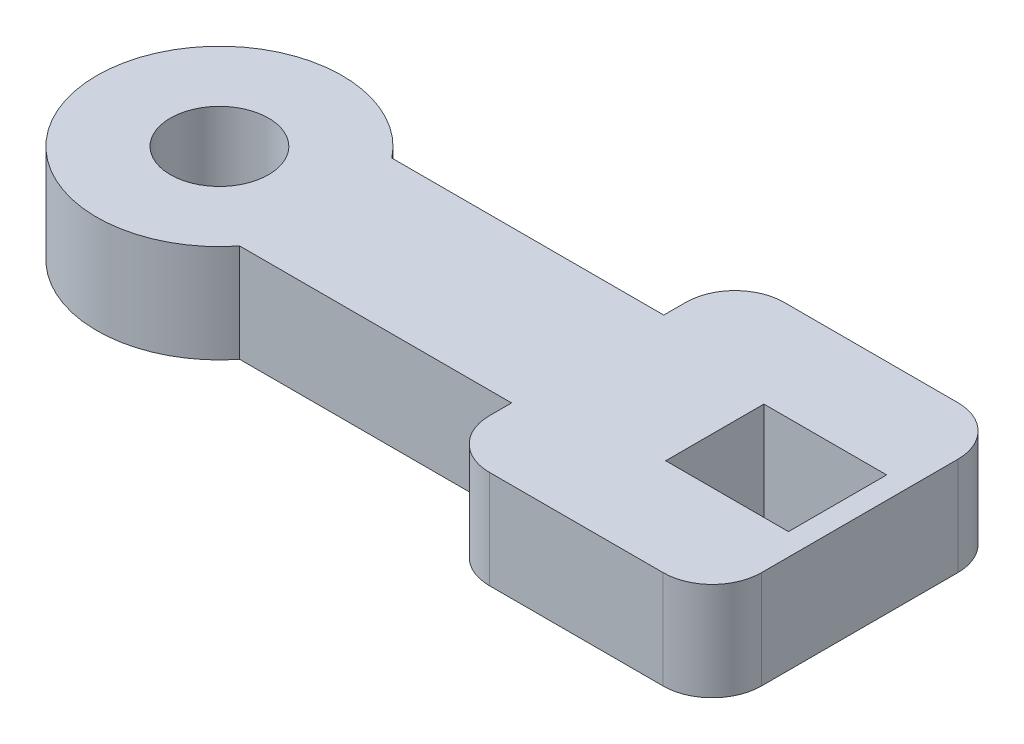
ISO-10303-21;
HEADER;
FILE_DESCRIPTION(('STEP AP214'),'2;1');
FILE_NAME('part.step','',(''),(''),'','','');
FILE_SCHEMA(('AUTOMOTIVE_DESIGN { 1 0 10303 214 1 1 1 1 }'));
ENDSEC;
DATA;
#1=APPLICATION_CONTEXT('core data for automotive mechanical design processes');
#2=APPLICATION_PROTOCOL_DEFINITION('international standard','automotive_design',2000,#1);
#3=PRODUCT_CONTEXT('',#1,'mechanical');
#4=PRODUCT('Part','Part','',(#3));
#5=PRODUCT_RELATED_PRODUCT_CATEGORY('part','',(#4));
#6=PRODUCT_DEFINITION_FORMATION('','',#4);
#7=PRODUCT_DEFINITION_CONTEXT('part definition',#1,'design');
#8=PRODUCT_DEFINITION('design','',#6,#7);
#9=PRODUCT_DEFINITION_SHAPE('','',#8);
#10=(LENGTH_UNIT() NAMED_UNIT(*) SI_UNIT(.MILLI.,.METRE.));
#11=(NAMED_UNIT(*) PLANE_ANGLE_UNIT() SI_UNIT($,.RADIAN.));
#12=(NAMED_UNIT(*) SI_UNIT($,.STERADIAN.) SOLID_ANGLE_UNIT());
#13=UNCERTAINTY_MEASURE_WITH_UNIT(LENGTH_MEASURE(1.E-05),#10,'distance_accuracy_value','');
#14=(GEOMETRIC_REPRESENTATION_CONTEXT(3) GLOBAL_UNCERTAINTY_ASSIGNED_CONTEXT((#13)) GLOBAL_UNIT_ASSIGNED_CONTEXT((#10,
#11,#12)) REPRESENTATION_CONTEXT('',''));
#15=CARTESIAN_POINT('',(0.,0.,0.));
#16=DIRECTION('',(0.,0.,1.));
#17=DIRECTION('',(1.,0.,0.));
#18=AXIS2_PLACEMENT_3D('',#15,#16,#17);
#19=CARTESIAN_POINT('',(15.0896575459696,2.,0.));
#20=DIRECTION('',(-1.,0.,0.));
#21=DIRECTION('',(0.,0.,1.));
#22=AXIS2_PLACEMENT_3D('',#19,#20,#21);
#23=PLANE('',#22);
#24=DIRECTION('',(0.,0.,-1.));
#25=VECTOR('',#24,1.);
#26=CARTESIAN_POINT('',(15.0896575459696,0.,0.));
#27=LINE('',#26,#25);
#28=CARTESIAN_POINT('',(15.0896575459696,0.,1.));
#29=VERTEX_POINT('',#28);
#30=CARTESIAN_POINT('',(15.0896575459696,0.,-1.));
#31=VERTEX_POINT('',#30);
#32=EDGE_CURVE('E241',#29,#31,#27,.T.);
#33=ORIENTED_EDGE('',*,*,#32,.F.);
#34=DIRECTION('',(0.,-1.,0.));
#35=VECTOR('',#34,1.);
#36=CARTESIAN_POINT('',(15.0896575459696,2.,1.));
#37=LINE('',#36,#35);
#38=CARTESIAN_POINT('',(15.0896575459696,2.,1.));
#39=VERTEX_POINT('',#38);
#40=EDGE_CURVE('E11',#39,#29,#37,.T.);
#41=ORIENTED_EDGE('',*,*,#40,.F.);
#42=DIRECTION('',(0.,0.,-1.));
#43=VECTOR('',#42,1.);
#44=CARTESIAN_POINT('',(15.0896575459696,2.,0.));
#45=LINE('',#44,#43);
#46=CARTESIAN_POINT('',(15.0896575459696,2.,-1.));
#47=VERTEX_POINT('',#46);
#48=EDGE_CURVE('E183',#39,#47,#45,.T.);
#49=ORIENTED_EDGE('',*,*,#48,.T.);
#50=DIRECTION('',(0.,-1.,0.));
#51=VECTOR('',#50,1.);
#52=CARTESIAN_POINT('',(15.0896575459696,2.,-1.));
#53=LINE('',#52,#51);
#54=EDGE_CURVE('E118',#47,#31,#53,.T.);
#55=ORIENTED_EDGE('',*,*,#54,.T.);
#56=EDGE_LOOP('',(#33,#41,#49,#55));
#57=FACE_BOUND('',#56,.T.);
#58=ADVANCED_FACE('F39',(#57),#23,.T.);
#59=CARTESIAN_POINT('',(0.,2.,1.));
#60=DIRECTION('',(0.,0.,-1.));
#61=DIRECTION('',(-1.,0.,0.));
#62=AXIS2_PLACEMENT_3D('',#59,#60,#61);
#63=PLANE('',#62);
#64=DIRECTION('',(1.,0.,0.));
#65=VECTOR('',#64,1.);
#66=CARTESIAN_POINT('',(0.,0.,1.));
#67=LINE('',#66,#65);
#68=CARTESIAN_POINT('',(12.5896575459696,0.,1.));
#69=VERTEX_POINT('',#68);
#70=EDGE_CURVE('E171',#69,#29,#67,.T.);
#71=ORIENTED_EDGE('',*,*,#70,.F.);
#72=DIRECTION('',(0.,-1.,0.));
#73=VECTOR('',#72,1.);
#74=CARTESIAN_POINT('',(12.5896575459696,2.,1.));
#75=LINE('',#74,#73);
#76=CARTESIAN_POINT('',(12.5896575459696,2.,1.));
#77=VERTEX_POINT('',#76);
#78=EDGE_CURVE('E50',#77,#69,#75,.T.);
#79=ORIENTED_EDGE('',*,*,#78,.F.);
#80=DIRECTION('',(1.,0.,0.));
#81=VECTOR('',#80,1.);
#82=CARTESIAN_POINT('',(0.,2.,1.));
#83=LINE('',#82,#81);
#84=EDGE_CURVE('E169',#77,#39,#83,.T.);
#85=ORIENTED_EDGE('',*,*,#84,.T.);
#86=ORIENTED_EDGE('',*,*,#40,.T.);
#87=EDGE_LOOP('',(#71,#79,#85,#86));
#88=FACE_BOUND('',#87,.T.);
#89=ADVANCED_FACE('F167',(#88),#63,.T.);
#90=CARTESIAN_POINT('',(12.5896575459696,2.,0.));
#91=DIRECTION('',(-1.,0.,0.));
#92=DIRECTION('',(0.,0.,1.));
#93=AXIS2_PLACEMENT_3D('',#90,#91,#92);
#94=PLANE('',#93);
#95=DIRECTION('',(0.,0.,-1.));
#96=VECTOR('',#95,1.);
#97=CARTESIAN_POINT('',(12.5896575459696,0.,0.));
#98=LINE('',#97,#96);
#99=CARTESIAN_POINT('',(12.5896575459696,0.,-1.));
#100=VERTEX_POINT('',#99);
#101=EDGE_CURVE('E246',#69,#100,#98,.T.);
#102=ORIENTED_EDGE('',*,*,#101,.T.);
#103=DIRECTION('',(0.,-1.,0.));
#104=VECTOR('',#103,1.);
#105=CARTESIAN_POINT('',(12.5896575459696,2.,-1.));
#106=LINE('',#105,#104);
#107=CARTESIAN_POINT('',(12.5896575459696,2.,-1.));
#108=VERTEX_POINT('',#107);
#109=EDGE_CURVE('E175',#108,#100,#106,.T.);
#110=ORIENTED_EDGE('',*,*,#109,.F.);
#111=DIRECTION('',(0.,0.,-1.));
#112=VECTOR('',#111,1.);
#113=CARTESIAN_POINT('',(12.5896575459696,2.,0.));
#114=LINE('',#113,#112);
#115=EDGE_CURVE('E178',#77,#108,#114,.T.);
#116=ORIENTED_EDGE('',*,*,#115,.F.);
#117=ORIENTED_EDGE('',*,*,#78,.T.);
#118=EDGE_LOOP('',(#102,#110,#116,#117));
#119=FACE_BOUND('',#118,.T.);
#120=ADVANCED_FACE('F179',(#119),#94,.F.);
#121=CARTESIAN_POINT('',(0.,2.,-1.55));
#122=DIRECTION('',(0.,0.,1.));
#123=DIRECTION('',(1.,0.,0.));
#124=AXIS2_PLACEMENT_3D('',#121,#122,#123);
#125=PLANE('',#124);
#126=DIRECTION('',(-1.,0.,0.));
#127=VECTOR('',#126,1.);
#128=CARTESIAN_POINT('',(0.,0.,-1.55));
#129=LINE('',#128,#127);
#130=CARTESIAN_POINT('',(10.,0.,-1.55));
#131=VERTEX_POINT('',#130);
#132=CARTESIAN_POINT('',(4.4615045245933,0.,-1.55));
#133=VERTEX_POINT('',#132);
#134=EDGE_CURVE('E198',#131,#133,#129,.T.);
#135=ORIENTED_EDGE('',*,*,#134,.T.);
#136=DIRECTION('',(0.,-1.,0.));
#137=VECTOR('',#136,1.);
#138=CARTESIAN_POINT('',(4.4615045245933,2.,-1.55));
#139=LINE('',#138,#137);
#140=CARTESIAN_POINT('',(4.4615045245933,2.,-1.55));
#141=VERTEX_POINT('',#140);
#142=EDGE_CURVE('E43',#141,#133,#139,.T.);
#143=ORIENTED_EDGE('',*,*,#142,.F.);
#144=DIRECTION('',(-1.,0.,0.));
#145=VECTOR('',#144,1.);
#146=CARTESIAN_POINT('',(0.,2.,-1.55));
#147=LINE('',#146,#145);
#148=CARTESIAN_POINT('',(10.,2.,-1.55));
#149=VERTEX_POINT('',#148);
#150=EDGE_CURVE('E310',#149,#141,#147,.T.);
#151=ORIENTED_EDGE('',*,*,#150,.F.);
#152=DIRECTION('',(0.,-1.,0.));
#153=VECTOR('',#152,1.);
#154=CARTESIAN_POINT('',(10.,2.,-1.55));
#155=LINE('',#154,#153);
#156=EDGE_CURVE('E193',#149,#131,#155,.T.);
#157=ORIENTED_EDGE('',*,*,#156,.T.);
#158=EDGE_LOOP('',(#135,#143,#151,#157));
#159=FACE_BOUND('',#158,.T.);
#160=ADVANCED_FACE('F297',(#159),#125,.F.);
#161=CARTESIAN_POINT('',(2.5,2.,0.));
#162=DIRECTION('',(0.,-1.,0.));
#163=DIRECTION('',(0.,0.,-1.));
#164=AXIS2_PLACEMENT_3D('',#161,#162,#163);
#165=CYLINDRICAL_SURFACE('',#164,2.5);
#166=CARTESIAN_POINT('',(2.5,0.,0.));
#167=DIRECTION('',(0.,1.,0.));
#168=DIRECTION('',(0.,0.,1.));
#169=AXIS2_PLACEMENT_3D('',#166,#167,#168);
#170=CIRCLE('',#169,2.5);
#171=CARTESIAN_POINT('',(4.4615045245933,0.,1.55));
#172=VERTEX_POINT('',#171);
#173=EDGE_CURVE('E202',#133,#172,#170,.T.);
#174=ORIENTED_EDGE('',*,*,#173,.T.);
#175=DIRECTION('',(0.,-1.,0.));
#176=VECTOR('',#175,1.);
#177=CARTESIAN_POINT('',(4.4615045245933,2.,1.55));
#178=LINE('',#177,#176);
#179=CARTESIAN_POINT('',(4.4615045245933,2.,1.55));
#180=VERTEX_POINT('',#179);
#181=EDGE_CURVE('E286',#180,#172,#178,.T.);
#182=ORIENTED_EDGE('',*,*,#181,.F.);
#183=CARTESIAN_POINT('',(2.5,2.,0.));
#184=DIRECTION('',(0.,1.,0.));
#185=DIRECTION('',(0.,0.,1.));
#186=AXIS2_PLACEMENT_3D('',#183,#184,#185);
#187=CIRCLE('',#186,2.5);
#188=EDGE_CURVE('E126',#141,#180,#187,.T.);
#189=ORIENTED_EDGE('',*,*,#188,.F.);
#190=ORIENTED_EDGE('',*,*,#142,.T.);
#191=EDGE_LOOP('',(#174,#182,#189,#190));
#192=FACE_BOUND('',#191,.T.);
#193=ADVANCED_FACE('F293',(#192),#165,.T.);
#194=CARTESIAN_POINT('',(0.,2.,1.55));
#195=DIRECTION('',(0.,0.,1.));
#196=DIRECTION('',(1.,0.,0.));
#197=AXIS2_PLACEMENT_3D('',#194,#195,#196);
#198=PLANE('',#197);
#199=DIRECTION('',(-1.,0.,0.));
#200=VECTOR('',#199,1.);
#201=CARTESIAN_POINT('',(0.,0.,1.55));
#202=LINE('',#201,#200);
#203=CARTESIAN_POINT('',(10.,0.,1.55));
#204=VERTEX_POINT('',#203);
#205=EDGE_CURVE('E206',#204,#172,#202,.T.);
#206=ORIENTED_EDGE('',*,*,#205,.F.);
#207=DIRECTION('',(0.,-1.,0.));
#208=VECTOR('',#207,1.);
#209=CARTESIAN_POINT('',(10.,2.,1.55));
#210=LINE('',#209,#208);
#211=CARTESIAN_POINT('',(10.,2.,1.55));
#212=VERTEX_POINT('',#211);
#213=EDGE_CURVE('E284',#212,#204,#210,.T.);
#214=ORIENTED_EDGE('',*,*,#213,.F.);
#215=DIRECTION('',(-1.,0.,0.));
#216=VECTOR('',#215,1.);
#217=CARTESIAN_POINT('',(0.,2.,1.55));
#218=LINE('',#217,#216);
#219=EDGE_CURVE('E315',#212,#180,#218,.T.);
#220=ORIENTED_EDGE('',*,*,#219,.T.);
#221=ORIENTED_EDGE('',*,*,#181,.T.);
#222=EDGE_LOOP('',(#206,#214,#220,#221));
#223=FACE_BOUND('',#222,.T.);
#224=ADVANCED_FACE('F383',(#223),#198,.T.);
#225=CARTESIAN_POINT('',(10.,2.,0.));
#226=DIRECTION('',(-1.,0.,0.));
#227=DIRECTION('',(0.,0.,1.));
#228=AXIS2_PLACEMENT_3D('',#225,#226,#227);
#229=PLANE('',#228);
#230=DIRECTION('',(0.,0.,-1.));
#231=VECTOR('',#230,1.);
#232=CARTESIAN_POINT('',(10.,0.,0.));
#233=LINE('',#232,#231);
#234=CARTESIAN_POINT('',(10.,0.,1.99999999999999));
#235=VERTEX_POINT('',#234);
#236=EDGE_CURVE('E210',#235,#204,#233,.T.);
#237=ORIENTED_EDGE('',*,*,#236,.F.);
#238=DIRECTION('',(0.,-1.,0.));
#239=VECTOR('',#238,1.);
#240=CARTESIAN_POINT('',(10.,2.,1.99999999999999));
#241=LINE('',#240,#239);
#242=CARTESIAN_POINT('',(10.,2.,1.99999999999999));
#243=VERTEX_POINT('',#242);
#244=EDGE_CURVE('E281',#243,#235,#241,.T.);
#245=ORIENTED_EDGE('',*,*,#244,.F.);
#246=DIRECTION('',(0.,0.,-1.));
#247=VECTOR('',#246,1.);
#248=CARTESIAN_POINT('',(10.,2.,0.));
#249=LINE('',#248,#247);
#250=EDGE_CURVE('E318',#243,#212,#249,.T.);
#251=ORIENTED_EDGE('',*,*,#250,.T.);
#252=ORIENTED_EDGE('',*,*,#213,.T.);
#253=EDGE_LOOP('',(#237,#245,#251,#252));
#254=FACE_BOUND('',#253,.T.);
#255=ADVANCED_FACE('F379',(#254),#229,.T.);
#256=CARTESIAN_POINT('',(11.,2.,2.));
#257=DIRECTION('',(0.,-1.,0.));
#258=DIRECTION('',(0.,0.,-1.));
#259=AXIS2_PLACEMENT_3D('',#256,#257,#258);
#260=CYLINDRICAL_SURFACE('',#259,1.);
#261=CARTESIAN_POINT('',(11.,0.,2.));
#262=DIRECTION('',(0.,1.,0.));
#263=DIRECTION('',(0.,0.,1.));
#264=AXIS2_PLACEMENT_3D('',#261,#262,#263);
#265=CIRCLE('',#264,1.);
#266=CARTESIAN_POINT('',(11.,0.,3.));
#267=VERTEX_POINT('',#266);
#268=EDGE_CURVE('E214',#235,#267,#265,.T.);
#269=ORIENTED_EDGE('',*,*,#268,.T.);
#270=DIRECTION('',(0.,-1.,0.));
#271=VECTOR('',#270,1.);
#272=CARTESIAN_POINT('',(11.,2.,3.));
#273=LINE('',#272,#271);
#274=CARTESIAN_POINT('',(11.,2.,3.));
#275=VERTEX_POINT('',#274);
#276=EDGE_CURVE('E277',#275,#267,#273,.T.);
#277=ORIENTED_EDGE('',*,*,#276,.F.);
#278=CARTESIAN_POINT('',(11.,2.,2.));
#279=DIRECTION('',(0.,1.,0.));
#280=DIRECTION('',(0.,0.,1.));
#281=AXIS2_PLACEMENT_3D('',#278,#279,#280);
#282=CIRCLE('',#281,1.);
#283=EDGE_CURVE('E322',#243,#275,#282,.T.);
#284=ORIENTED_EDGE('',*,*,#283,.F.);
#285=ORIENTED_EDGE('',*,*,#244,.T.);
#286=EDGE_LOOP('',(#269,#277,#284,#285));
#287=FACE_BOUND('',#286,.T.);
#288=ADVANCED_FACE('F390',(#287),#260,.T.);
#289=CARTESIAN_POINT('',(0.,2.,3.));
#290=DIRECTION('',(0.,0.,-1.));
#291=DIRECTION('',(-1.,0.,0.));
#292=AXIS2_PLACEMENT_3D('',#289,#290,#291);
#293=PLANE('',#292);
#294=DIRECTION('',(1.,0.,0.));
#295=VECTOR('',#294,1.);
#296=CARTESIAN_POINT('',(0.,0.,3.));
#297=LINE('',#296,#295);
#298=CARTESIAN_POINT('',(14.5384954754067,0.,3.));
#299=VERTEX_POINT('',#298);
#300=EDGE_CURVE('E218',#267,#299,#297,.T.);
#301=ORIENTED_EDGE('',*,*,#300,.T.);
#302=DIRECTION('',(0.,-1.,0.));
#303=VECTOR('',#302,1.);
#304=CARTESIAN_POINT('',(14.5384954754067,2.,3.));
#305=LINE('',#304,#303);
#306=CARTESIAN_POINT('',(14.5384954754067,2.,3.));
#307=VERTEX_POINT('',#306);
#308=EDGE_CURVE('E274',#307,#299,#305,.T.);
#309=ORIENTED_EDGE('',*,*,#308,.F.);
#310=DIRECTION('',(1.,0.,0.));
#311=VECTOR('',#310,1.);
#312=CARTESIAN_POINT('',(0.,2.,3.));
#313=LINE('',#312,#311);
#314=EDGE_CURVE('E325',#275,#307,#313,.T.);
#315=ORIENTED_EDGE('',*,*,#314,.F.);
#316=ORIENTED_EDGE('',*,*,#276,.T.);
#317=EDGE_LOOP('',(#301,#309,#315,#316));
#318=FACE_BOUND('',#317,.T.);
#319=ADVANCED_FACE('F373',(#318),#293,.F.);
#320=CARTESIAN_POINT('',(14.5384954754067,2.,2.));
#321=DIRECTION('',(0.,-1.,0.));
#322=DIRECTION('',(0.,0.,-1.));
#323=AXIS2_PLACEMENT_3D('',#320,#321,#322);
#324=CYLINDRICAL_SURFACE('',#323,1.);
#325=CARTESIAN_POINT('',(14.5384954754067,0.,2.));
#326=DIRECTION('',(0.,1.,0.));
#327=DIRECTION('',(0.,0.,1.));
#328=AXIS2_PLACEMENT_3D('',#325,#326,#327);
#329=CIRCLE('',#328,1.);
#330=CARTESIAN_POINT('',(15.5384954754067,0.,1.99999999999999));
#331=VERTEX_POINT('',#330);
#332=EDGE_CURVE('E222',#331,#299,#329,.F.);
#333=ORIENTED_EDGE('',*,*,#332,.F.);
#334=DIRECTION('',(0.,-1.,0.));
#335=VECTOR('',#334,1.);
#336=CARTESIAN_POINT('',(15.5384954754067,2.,1.99999999999999));
#337=LINE('',#336,#335);
#338=CARTESIAN_POINT('',(15.5384954754067,2.,1.99999999999999));
#339=VERTEX_POINT('',#338);
#340=EDGE_CURVE('E271',#339,#331,#337,.T.);
#341=ORIENTED_EDGE('',*,*,#340,.F.);
#342=CARTESIAN_POINT('',(14.5384954754067,2.,2.));
#343=DIRECTION('',(0.,1.,0.));
#344=DIRECTION('',(0.,0.,1.));
#345=AXIS2_PLACEMENT_3D('',#342,#343,#344);
#346=CIRCLE('',#345,1.);
#347=EDGE_CURVE('E328',#339,#307,#346,.F.);
#348=ORIENTED_EDGE('',*,*,#347,.T.);
#349=ORIENTED_EDGE('',*,*,#308,.T.);
#350=EDGE_LOOP('',(#333,#341,#348,#349));
#351=FACE_BOUND('',#350,.T.);
#352=ADVANCED_FACE('F369',(#351),#324,.T.);
#353=CARTESIAN_POINT('',(15.5384954754067,2.,0.));
#354=DIRECTION('',(-1.,0.,0.));
#355=DIRECTION('',(0.,0.,1.));
#356=AXIS2_PLACEMENT_3D('',#353,#354,#355);
#357=PLANE('',#356);
#358=DIRECTION('',(0.,0.,-1.));
#359=VECTOR('',#358,1.);
#360=CARTESIAN_POINT('',(15.5384954754067,0.,0.));
#361=LINE('',#360,#359);
#362=CARTESIAN_POINT('',(15.5384954754067,0.,-1.99999999999999));
#363=VERTEX_POINT('',#362);
#364=EDGE_CURVE('E226',#331,#363,#361,.T.);
#365=ORIENTED_EDGE('',*,*,#364,.T.);
#366=DIRECTION('',(0.,-1.,0.));
#367=VECTOR('',#366,1.);
#368=CARTESIAN_POINT('',(15.5384954754067,2.,-1.99999999999999));
#369=LINE('',#368,#367);
#370=CARTESIAN_POINT('',(15.5384954754067,2.,-1.99999999999999));
#371=VERTEX_POINT('',#370);
#372=EDGE_CURVE('E267',#371,#363,#369,.T.);
#373=ORIENTED_EDGE('',*,*,#372,.F.);
#374=DIRECTION('',(0.,0.,-1.));
#375=VECTOR('',#374,1.);
#376=CARTESIAN_POINT('',(15.5384954754067,2.,0.));
#377=LINE('',#376,#375);
#378=EDGE_CURVE('E332',#339,#371,#377,.T.);
#379=ORIENTED_EDGE('',*,*,#378,.F.);
#380=ORIENTED_EDGE('',*,*,#340,.T.);
#381=EDGE_LOOP('',(#365,#373,#379,#380));
#382=FACE_BOUND('',#381,.T.);
#383=ADVANCED_FACE('F364',(#382),#357,.F.);
#384=CARTESIAN_POINT('',(14.5384954754067,2.,-2.));
#385=DIRECTION('',(0.,-1.,0.));
#386=DIRECTION('',(0.,0.,-1.));
#387=AXIS2_PLACEMENT_3D('',#384,#385,#386);
#388=CYLINDRICAL_SURFACE('',#387,1.);
#389=CARTESIAN_POINT('',(14.5384954754067,0.,-2.));
#390=DIRECTION('',(0.,1.,0.));
#391=DIRECTION('',(0.,0.,1.));
#392=AXIS2_PLACEMENT_3D('',#389,#390,#391);
#393=CIRCLE('',#392,1.);
#394=CARTESIAN_POINT('',(14.5384954754067,0.,-3.));
#395=VERTEX_POINT('',#394);
#396=EDGE_CURVE('E229',#363,#395,#393,.T.);
#397=ORIENTED_EDGE('',*,*,#396,.T.);
#398=DIRECTION('',(0.,-1.,0.));
#399=VECTOR('',#398,1.);
#400=CARTESIAN_POINT('',(14.5384954754067,2.,-3.));
#401=LINE('',#400,#399);
#402=CARTESIAN_POINT('',(14.5384954754067,2.,-3.));
#403=VERTEX_POINT('',#402);
#404=EDGE_CURVE('E264',#403,#395,#401,.T.);
#405=ORIENTED_EDGE('',*,*,#404,.F.);
#406=CARTESIAN_POINT('',(14.5384954754067,2.,-2.));
#407=DIRECTION('',(0.,1.,0.));
#408=DIRECTION('',(0.,0.,1.));
#409=AXIS2_PLACEMENT_3D('',#406,#407,#408);
#410=CIRCLE('',#409,1.);
#411=EDGE_CURVE('E335',#371,#403,#410,.T.);
#412=ORIENTED_EDGE('',*,*,#411,.F.);
#413=ORIENTED_EDGE('',*,*,#372,.T.);
#414=EDGE_LOOP('',(#397,#405,#412,#413));
#415=FACE_BOUND('',#414,.T.);
#416=ADVANCED_FACE('F360',(#415),#388,.T.);
#417=CARTESIAN_POINT('',(0.,2.,-3.));
#418=DIRECTION('',(0.,0.,-1.));
#419=DIRECTION('',(-1.,0.,0.));
#420=AXIS2_PLACEMENT_3D('',#417,#418,#419);
#421=PLANE('',#420);
#422=DIRECTION('',(1.,0.,0.));
#423=VECTOR('',#422,1.);
#424=CARTESIAN_POINT('',(0.,0.,-3.));
#425=LINE('',#424,#423);
#426=CARTESIAN_POINT('',(11.,0.,-3.));
#427=VERTEX_POINT('',#426);
#428=EDGE_CURVE('E233',#427,#395,#425,.T.);
#429=ORIENTED_EDGE('',*,*,#428,.F.);
#430=DIRECTION('',(0.,-1.,0.));
#431=VECTOR('',#430,1.);
#432=CARTESIAN_POINT('',(11.,2.,-3.));
#433=LINE('',#432,#431);
#434=CARTESIAN_POINT('',(11.,2.,-3.));
#435=VERTEX_POINT('',#434);
#436=EDGE_CURVE('E261',#435,#427,#433,.T.);
#437=ORIENTED_EDGE('',*,*,#436,.F.);
#438=DIRECTION('',(1.,0.,0.));
#439=VECTOR('',#438,1.);
#440=CARTESIAN_POINT('',(0.,2.,-3.));
#441=LINE('',#440,#439);
#442=EDGE_CURVE('E338',#435,#403,#441,.T.);
#443=ORIENTED_EDGE('',*,*,#442,.T.);
#444=ORIENTED_EDGE('',*,*,#404,.T.);
#445=EDGE_LOOP('',(#429,#437,#443,#444));
#446=FACE_BOUND('',#445,.T.);
#447=ADVANCED_FACE('F356',(#446),#421,.T.);
#448=CARTESIAN_POINT('',(11.,2.,-2.));
#449=DIRECTION('',(0.,-1.,0.));
#450=DIRECTION('',(0.,0.,-1.));
#451=AXIS2_PLACEMENT_3D('',#448,#449,#450);
#452=CYLINDRICAL_SURFACE('',#451,1.);
#453=CARTESIAN_POINT('',(11.,0.,-2.));
#454=DIRECTION('',(0.,1.,0.));
#455=DIRECTION('',(0.,0.,1.));
#456=AXIS2_PLACEMENT_3D('',#453,#454,#455);
#457=CIRCLE('',#456,1.);
#458=CARTESIAN_POINT('',(10.,0.,-1.99999999999999));
#459=VERTEX_POINT('',#458);
#460=EDGE_CURVE('E237',#459,#427,#457,.F.);
#461=ORIENTED_EDGE('',*,*,#460,.F.);
#462=DIRECTION('',(0.,-1.,0.));
#463=VECTOR('',#462,1.);
#464=CARTESIAN_POINT('',(10.,2.,-1.99999999999999));
#465=LINE('',#464,#463);
#466=CARTESIAN_POINT('',(10.,2.,-1.99999999999999));
#467=VERTEX_POINT('',#466);
#468=EDGE_CURVE('E258',#467,#459,#465,.T.);
#469=ORIENTED_EDGE('',*,*,#468,.F.);
#470=CARTESIAN_POINT('',(11.,2.,-2.));
#471=DIRECTION('',(0.,1.,0.));
#472=DIRECTION('',(0.,0.,1.));
#473=AXIS2_PLACEMENT_3D('',#470,#471,#472);
#474=CIRCLE('',#473,1.);
#475=EDGE_CURVE('E342',#467,#435,#474,.F.);
#476=ORIENTED_EDGE('',*,*,#475,.T.);
#477=ORIENTED_EDGE('',*,*,#436,.T.);
#478=EDGE_LOOP('',(#461,#469,#476,#477));
#479=FACE_BOUND('',#478,.T.);
#480=ADVANCED_FACE('F351',(#479),#452,.T.);
#481=EDGE_CURVE('E215',#131,#459,#233,.T.);
#482=ORIENTED_EDGE('',*,*,#481,.F.);
#483=ORIENTED_EDGE('',*,*,#156,.F.);
#484=EDGE_CURVE('E187',#149,#467,#249,.T.);
#485=ORIENTED_EDGE('',*,*,#484,.T.);
#486=ORIENTED_EDGE('',*,*,#468,.T.);
#487=EDGE_LOOP('',(#482,#483,#485,#486));
#488=FACE_BOUND('',#487,.T.);
#489=ADVANCED_FACE('F303',(#488),#229,.T.);
#490=CARTESIAN_POINT('',(2.5,2.,0.));
#491=DIRECTION('',(0.,-1.,0.));
#492=DIRECTION('',(0.,0.,-1.));
#493=AXIS2_PLACEMENT_3D('',#490,#491,#492);
#494=CYLINDRICAL_SURFACE('',#493,1.);
#495=CARTESIAN_POINT('',(2.5,2.,0.));
#496=DIRECTION('',(0.,1.,0.));
#497=DIRECTION('',(0.,0.,1.));
#498=AXIS2_PLACEMENT_3D('',#495,#496,#497);
#499=CIRCLE('',#498,1.);
#500=CARTESIAN_POINT('',(2.5,2.,1.));
#501=VERTEX_POINT('',#500);
#502=EDGE_CURVE('E251',#501,#501,#499,.T.);
#503=ORIENTED_EDGE('',*,*,#502,.T.);
#504=EDGE_LOOP('',(#503));
#505=FACE_BOUND('',#504,.T.);
#506=CARTESIAN_POINT('',(2.5,0.,0.));
#507=DIRECTION('',(0.,1.,0.));
#508=DIRECTION('',(0.,0.,1.));
#509=AXIS2_PLACEMENT_3D('',#506,#507,#508);
#510=CIRCLE('',#509,1.);
#511=CARTESIAN_POINT('',(2.5,0.,1.));
#512=VERTEX_POINT('',#511);
#513=EDGE_CURVE('E194',#512,#512,#510,.T.);
#514=ORIENTED_EDGE('',*,*,#513,.F.);
#515=EDGE_LOOP('',(#514));
#516=FACE_BOUND('',#515,.T.);
#517=ADVANCED_FACE('F41',(#505,#516),#494,.F.);
#518=CARTESIAN_POINT('',(0.,2.,-0.999999999999999));
#519=DIRECTION('',(0.,0.,-1.));
#520=DIRECTION('',(-1.,0.,0.));
#521=AXIS2_PLACEMENT_3D('',#518,#519,#520);
#522=PLANE('',#521);
#523=DIRECTION('',(1.,0.,0.));
#524=VECTOR('',#523,1.);
#525=CARTESIAN_POINT('',(0.,0.,-0.999999999999999));
#526=LINE('',#525,#524);
#527=EDGE_CURVE('E111',#100,#31,#526,.T.);
#528=ORIENTED_EDGE('',*,*,#527,.T.);
#529=ORIENTED_EDGE('',*,*,#54,.F.);
#530=DIRECTION('',(1.,0.,0.));
#531=VECTOR('',#530,1.);
#532=CARTESIAN_POINT('',(0.,2.,-0.999999999999999));
#533=LINE('',#532,#531);
#534=EDGE_CURVE('E59',#108,#47,#533,.T.);
#535=ORIENTED_EDGE('',*,*,#534,.F.);
#536=ORIENTED_EDGE('',*,*,#109,.T.);
#537=EDGE_LOOP('',(#528,#529,#535,#536));
#538=FACE_BOUND('',#537,.T.);
#539=ADVANCED_FACE('F453',(#538),#522,.F.);
#540=CARTESIAN_POINT('',(0.,2.,0.));
#541=DIRECTION('',(0.,1.,0.));
#542=DIRECTION('',(0.,0.,1.));
#543=AXIS2_PLACEMENT_3D('',#540,#541,#542);
#544=PLANE('',#543);
#545=ORIENTED_EDGE('',*,*,#502,.F.);
#546=EDGE_LOOP('',(#545));
#547=FACE_BOUND('',#546,.T.);
#548=ORIENTED_EDGE('',*,*,#150,.T.);
#549=ORIENTED_EDGE('',*,*,#188,.T.);
#550=ORIENTED_EDGE('',*,*,#219,.F.);
#551=ORIENTED_EDGE('',*,*,#250,.F.);
#552=ORIENTED_EDGE('',*,*,#283,.T.);
#553=ORIENTED_EDGE('',*,*,#314,.T.);
#554=ORIENTED_EDGE('',*,*,#347,.F.);
#555=ORIENTED_EDGE('',*,*,#378,.T.);
#556=ORIENTED_EDGE('',*,*,#411,.T.);
#557=ORIENTED_EDGE('',*,*,#442,.F.);
#558=ORIENTED_EDGE('',*,*,#475,.F.);
#559=ORIENTED_EDGE('',*,*,#484,.F.);
#560=EDGE_LOOP('',(#548,#549,#550,#551,#552,#553,#554,#555,#556,#557,#558,#559));
#561=FACE_BOUND('',#560,.T.);
#562=ORIENTED_EDGE('',*,*,#48,.F.);
#563=ORIENTED_EDGE('',*,*,#84,.F.);
#564=ORIENTED_EDGE('',*,*,#115,.T.);
#565=ORIENTED_EDGE('',*,*,#534,.T.);
#566=EDGE_LOOP('',(#562,#563,#564,#565));
#567=FACE_BOUND('',#566,.T.);
#568=ADVANCED_FACE('F182',(#547,#561,#567),#544,.T.);
#569=CARTESIAN_POINT('',(0.,0.,0.));
#570=DIRECTION('',(0.,1.,0.));
#571=DIRECTION('',(0.,0.,1.));
#572=AXIS2_PLACEMENT_3D('',#569,#570,#571);
#573=PLANE('',#572);
#574=ORIENTED_EDGE('',*,*,#513,.T.);
#575=EDGE_LOOP('',(#574));
#576=FACE_BOUND('',#575,.T.);
#577=ORIENTED_EDGE('',*,*,#134,.F.);
#578=ORIENTED_EDGE('',*,*,#481,.T.);
#579=ORIENTED_EDGE('',*,*,#460,.T.);
#580=ORIENTED_EDGE('',*,*,#428,.T.);
#581=ORIENTED_EDGE('',*,*,#396,.F.);
#582=ORIENTED_EDGE('',*,*,#364,.F.);
#583=ORIENTED_EDGE('',*,*,#332,.T.);
#584=ORIENTED_EDGE('',*,*,#300,.F.);
#585=ORIENTED_EDGE('',*,*,#268,.F.);
#586=ORIENTED_EDGE('',*,*,#236,.T.);
#587=ORIENTED_EDGE('',*,*,#205,.T.);
#588=ORIENTED_EDGE('',*,*,#173,.F.);
#589=EDGE_LOOP('',(#577,#578,#579,#580,#581,#582,#583,#584,#585,#586,#587,#588));
#590=FACE_BOUND('',#589,.T.);
#591=ORIENTED_EDGE('',*,*,#32,.T.);
#592=ORIENTED_EDGE('',*,*,#527,.F.);
#593=ORIENTED_EDGE('',*,*,#101,.F.);
#594=ORIENTED_EDGE('',*,*,#70,.T.);
#595=EDGE_LOOP('',(#591,#592,#593,#594));
#596=FACE_BOUND('',#595,.T.);
#597=ADVANCED_FACE('F301',(#576,#590,#596),#573,.F.);
#598=CLOSED_SHELL('',(#58,#89,#120,#160,#193,#224,#255,#288,#319,#352,#383,#416,#447,#480,#489,
#517,#539,#568,#597));
#599=MANIFOLD_SOLID_BREP('B2',#598);
#600=ADVANCED_BREP_SHAPE_REPRESENTATION('',(#18,#599),#14);
#601=SHAPE_DEFINITION_REPRESENTATION(#9,#600);
ENDSEC;
END-ISO-10303-21;
